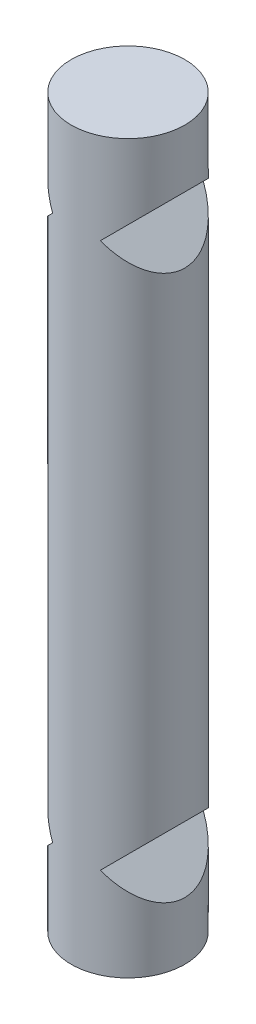
ISO-10303-21;
HEADER;
FILE_DESCRIPTION(('STEP AP214'),'2;1');
FILE_NAME('part.step','',(''),(''),'','','');
FILE_SCHEMA(('AUTOMOTIVE_DESIGN { 1 0 10303 214 1 1 1 1 }'));
ENDSEC;
DATA;
#1=APPLICATION_CONTEXT('core data for automotive mechanical design processes');
#2=APPLICATION_PROTOCOL_DEFINITION('international standard','automotive_design',2000,#1);
#3=PRODUCT_CONTEXT('',#1,'mechanical');
#4=PRODUCT('Part','Part','',(#3));
#5=PRODUCT_RELATED_PRODUCT_CATEGORY('part','',(#4));
#6=PRODUCT_DEFINITION_FORMATION('','',#4);
#7=PRODUCT_DEFINITION_CONTEXT('part definition',#1,'design');
#8=PRODUCT_DEFINITION('design','',#6,#7);
#9=PRODUCT_DEFINITION_SHAPE('','',#8);
#10=(LENGTH_UNIT() NAMED_UNIT(*) SI_UNIT(.MILLI.,.METRE.));
#11=(NAMED_UNIT(*) PLANE_ANGLE_UNIT() SI_UNIT($,.RADIAN.));
#12=(NAMED_UNIT(*) SI_UNIT($,.STERADIAN.) SOLID_ANGLE_UNIT());
#13=UNCERTAINTY_MEASURE_WITH_UNIT(LENGTH_MEASURE(1.E-05),#10,'distance_accuracy_value','');
#14=(GEOMETRIC_REPRESENTATION_CONTEXT(3) GLOBAL_UNCERTAINTY_ASSIGNED_CONTEXT((#13)) GLOBAL_UNIT_ASSIGNED_CONTEXT((#10,
#11,#12)) REPRESENTATION_CONTEXT('',''));
#15=CARTESIAN_POINT('',(0.,0.,0.));
#16=DIRECTION('',(0.,0.,1.));
#17=DIRECTION('',(1.,0.,0.));
#18=AXIS2_PLACEMENT_3D('',#15,#16,#17);
#19=CARTESIAN_POINT('',(0.,6.,0.));
#20=DIRECTION('',(0.,-1.,0.));
#21=DIRECTION('',(0.,0.,-1.));
#22=AXIS2_PLACEMENT_3D('',#19,#20,#21);
#23=CYLINDRICAL_SURFACE('',#22,1.25);
#24=CARTESIAN_POINT('',(0.,-2.47523687851957,0.));
#25=DIRECTION('',(-0.707106781186543,-0.707106781186552,0.));
#26=DIRECTION('',(0.707106781186552,-0.707106781186543,0.));
#27=AXIS2_PLACEMENT_3D('',#24,#25,#26);
#28=ELLIPSE('',#27,1.76776695296636,1.25);
#29=CARTESIAN_POINT('',(0.524763121480433,-3.,-1.13451472724426));
#30=VERTEX_POINT('',#29);
#31=CARTESIAN_POINT('',(0.524763121480433,-3.,1.13451472724426));
#32=VERTEX_POINT('',#31);
#33=EDGE_CURVE('E11',#30,#32,#28,.T.);
#34=ORIENTED_EDGE('',*,*,#33,.T.);
#35=CARTESIAN_POINT('',(0.,-3.52476312148043,0.));
#36=DIRECTION('',(-0.707106781186546,0.707106781186549,0.));
#37=DIRECTION('',(-0.707106781186549,-0.707106781186546,0.));
#38=AXIS2_PLACEMENT_3D('',#35,#36,#37);
#39=ELLIPSE('',#38,1.76776695296636,1.25);
#40=EDGE_CURVE('E47',#32,#30,#39,.T.);
#41=ORIENTED_EDGE('',*,*,#40,.T.);
#42=EDGE_LOOP('',(#34,#41));
#43=FACE_BOUND('',#42,.T.);
#44=CARTESIAN_POINT('',(0.,-2.47523687851959,0.));
#45=DIRECTION('',(0.707106781186546,-0.707106781186549,0.));
#46=DIRECTION('',(-0.707106781186549,-0.707106781186546,0.));
#47=AXIS2_PLACEMENT_3D('',#44,#45,#46);
#48=ELLIPSE('',#47,1.76776695296636,1.25);
#49=CARTESIAN_POINT('',(-0.524763121480417,-3.,1.13451472724426));
#50=VERTEX_POINT('',#49);
#51=CARTESIAN_POINT('',(-0.524763121480417,-3.,-1.13451472724427));
#52=VERTEX_POINT('',#51);
#53=EDGE_CURVE('E116',#50,#52,#48,.T.);
#54=ORIENTED_EDGE('',*,*,#53,.T.);
#55=CARTESIAN_POINT('',(0.,-3.52476312148041,0.));
#56=DIRECTION('',(0.707106781186543,0.707106781186552,0.));
#57=DIRECTION('',(0.707106781186552,-0.707106781186543,0.));
#58=AXIS2_PLACEMENT_3D('',#55,#56,#57);
#59=ELLIPSE('',#58,1.76776695296636,1.25);
#60=EDGE_CURVE('E120',#52,#50,#59,.T.);
#61=ORIENTED_EDGE('',*,*,#60,.T.);
#62=EDGE_LOOP('',(#54,#61));
#63=FACE_BOUND('',#62,.T.);
#64=CARTESIAN_POINT('',(0.,9.52476312148042,0.));
#65=DIRECTION('',(0.707106781186544,-0.707106781186551,0.));
#66=DIRECTION('',(-0.707106781186551,-0.707106781186544,0.));
#67=AXIS2_PLACEMENT_3D('',#64,#65,#66);
#68=ELLIPSE('',#67,1.76776695296636,1.25);
#69=CARTESIAN_POINT('',(-0.524763121480425,9.,1.13451472724426));
#70=VERTEX_POINT('',#69);
#71=CARTESIAN_POINT('',(-0.524763121480425,9.,-1.13451472724426));
#72=VERTEX_POINT('',#71);
#73=EDGE_CURVE('E85',#70,#72,#68,.T.);
#74=ORIENTED_EDGE('',*,*,#73,.T.);
#75=CARTESIAN_POINT('',(0.,8.47523687851958,0.));
#76=DIRECTION('',(0.707106781186544,0.707106781186551,0.));
#77=DIRECTION('',(0.707106781186551,-0.707106781186544,0.));
#78=AXIS2_PLACEMENT_3D('',#75,#76,#77);
#79=ELLIPSE('',#78,1.76776695296636,1.25);
#80=EDGE_CURVE('E112',#72,#70,#79,.T.);
#81=ORIENTED_EDGE('',*,*,#80,.T.);
#82=EDGE_LOOP('',(#74,#81));
#83=FACE_BOUND('',#82,.T.);
#84=CARTESIAN_POINT('',(0.,9.52476312148042,0.));
#85=DIRECTION('',(-0.707106781186544,-0.707106781186551,0.));
#86=DIRECTION('',(0.707106781186551,-0.707106781186544,0.));
#87=AXIS2_PLACEMENT_3D('',#84,#85,#86);
#88=ELLIPSE('',#87,1.76776695296636,1.25);
#89=CARTESIAN_POINT('',(0.524763121480425,9.,-1.13451472724426));
#90=VERTEX_POINT('',#89);
#91=CARTESIAN_POINT('',(0.524763121480425,9.,1.13451472724426));
#92=VERTEX_POINT('',#91);
#93=EDGE_CURVE('E80',#90,#92,#88,.T.);
#94=ORIENTED_EDGE('',*,*,#93,.T.);
#95=CARTESIAN_POINT('',(0.,8.47523687851958,0.));
#96=DIRECTION('',(-0.707106781186544,0.707106781186551,0.));
#97=DIRECTION('',(-0.707106781186551,-0.707106781186544,0.));
#98=AXIS2_PLACEMENT_3D('',#95,#96,#97);
#99=ELLIPSE('',#98,1.76776695296636,1.25);
#100=EDGE_CURVE('E82',#92,#90,#99,.T.);
#101=ORIENTED_EDGE('',*,*,#100,.T.);
#102=EDGE_LOOP('',(#94,#101));
#103=FACE_BOUND('',#102,.T.);
#104=CARTESIAN_POINT('',(0.,-5.,0.));
#105=DIRECTION('',(0.,-1.,0.));
#106=DIRECTION('',(0.,0.,-1.));
#107=AXIS2_PLACEMENT_3D('',#104,#105,#106);
#108=CIRCLE('',#107,1.25);
#109=CARTESIAN_POINT('',(0.,-5.,-1.25));
#110=VERTEX_POINT('',#109);
#111=EDGE_CURVE('E89',#110,#110,#108,.T.);
#112=ORIENTED_EDGE('',*,*,#111,.F.);
#113=EDGE_LOOP('',(#112));
#114=FACE_BOUND('',#113,.T.);
#115=CARTESIAN_POINT('',(0.,11.,0.));
#116=DIRECTION('',(0.,1.,0.));
#117=DIRECTION('',(0.,0.,1.));
#118=AXIS2_PLACEMENT_3D('',#115,#116,#117);
#119=CIRCLE('',#118,1.25);
#120=CARTESIAN_POINT('',(0.,11.,1.25));
#121=VERTEX_POINT('',#120);
#122=EDGE_CURVE('E93',#121,#121,#119,.T.);
#123=ORIENTED_EDGE('',*,*,#122,.F.);
#124=EDGE_LOOP('',(#123));
#125=FACE_BOUND('',#124,.T.);
#126=ADVANCED_FACE('F39',(#43,#63,#83,#103,#114,#125),#23,.T.);
#127=CARTESIAN_POINT('',(0.,-5.,0.));
#128=DIRECTION('',(0.,-1.,0.));
#129=DIRECTION('',(0.,0.,-1.));
#130=AXIS2_PLACEMENT_3D('',#127,#128,#129);
#131=PLANE('',#130);
#132=ORIENTED_EDGE('',*,*,#111,.T.);
#133=EDGE_LOOP('',(#132));
#134=FACE_BOUND('',#133,.T.);
#135=ADVANCED_FACE('F150',(#134),#131,.T.);
#136=CARTESIAN_POINT('',(0.,11.,0.));
#137=DIRECTION('',(0.,1.,0.));
#138=DIRECTION('',(0.,0.,1.));
#139=AXIS2_PLACEMENT_3D('',#136,#137,#138);
#140=PLANE('',#139);
#141=ORIENTED_EDGE('',*,*,#122,.T.);
#142=EDGE_LOOP('',(#141));
#143=FACE_BOUND('',#142,.T.);
#144=ADVANCED_FACE('F154',(#143),#140,.T.);
#145=CARTESIAN_POINT('',(0.524763121480425,9.,-1.25));
#146=DIRECTION('',(-0.707106781186544,-0.707106781186551,0.));
#147=DIRECTION('',(0.707106781186551,-0.707106781186544,0.));
#148=AXIS2_PLACEMENT_3D('',#145,#146,#147);
#149=PLANE('',#148);
#150=ORIENTED_EDGE('',*,*,#93,.F.);
#151=DIRECTION('',(0.,0.,1.));
#152=VECTOR('',#151,1.);
#153=CARTESIAN_POINT('',(0.524763121480425,9.,-1.25));
#154=LINE('',#153,#152);
#155=EDGE_CURVE('E60',#90,#92,#154,.T.);
#156=ORIENTED_EDGE('',*,*,#155,.T.);
#157=EDGE_LOOP('',(#150,#156));
#158=FACE_BOUND('',#157,.T.);
#159=ADVANCED_FACE('F91',(#158),#149,.F.);
#160=CARTESIAN_POINT('',(0.524763121480425,9.,-1.25));
#161=DIRECTION('',(-0.707106781186544,0.707106781186551,0.));
#162=DIRECTION('',(-0.707106781186551,-0.707106781186544,0.));
#163=AXIS2_PLACEMENT_3D('',#160,#161,#162);
#164=PLANE('',#163);
#165=ORIENTED_EDGE('',*,*,#155,.F.);
#166=ORIENTED_EDGE('',*,*,#100,.F.);
#167=EDGE_LOOP('',(#165,#166));
#168=FACE_BOUND('',#167,.T.);
#169=ADVANCED_FACE('F87',(#168),#164,.F.);
#170=CARTESIAN_POINT('',(-0.524763121480425,9.,-1.25));
#171=DIRECTION('',(0.707106781186544,0.707106781186551,0.));
#172=DIRECTION('',(-0.707106781186551,0.707106781186544,0.));
#173=AXIS2_PLACEMENT_3D('',#170,#171,#172);
#174=PLANE('',#173);
#175=DIRECTION('',(0.,0.,1.));
#176=VECTOR('',#175,1.);
#177=CARTESIAN_POINT('',(-0.524763121480425,9.,-1.25));
#178=LINE('',#177,#176);
#179=EDGE_CURVE('E94',#72,#70,#178,.T.);
#180=ORIENTED_EDGE('',*,*,#179,.T.);
#181=ORIENTED_EDGE('',*,*,#80,.F.);
#182=EDGE_LOOP('',(#180,#181));
#183=FACE_BOUND('',#182,.T.);
#184=ADVANCED_FACE('F165',(#183),#174,.F.);
#185=CARTESIAN_POINT('',(-0.524763121480425,9.,-1.25));
#186=DIRECTION('',(0.707106781186544,-0.707106781186551,0.));
#187=DIRECTION('',(0.707106781186551,0.707106781186544,0.));
#188=AXIS2_PLACEMENT_3D('',#185,#186,#187);
#189=PLANE('',#188);
#190=ORIENTED_EDGE('',*,*,#73,.F.);
#191=ORIENTED_EDGE('',*,*,#179,.F.);
#192=EDGE_LOOP('',(#190,#191));
#193=FACE_BOUND('',#192,.T.);
#194=ADVANCED_FACE('F146',(#193),#189,.F.);
#195=CARTESIAN_POINT('',(-0.524763121480417,-3.,-1.25));
#196=DIRECTION('',(0.707106781186543,0.707106781186552,0.));
#197=DIRECTION('',(-0.707106781186552,0.707106781186543,0.));
#198=AXIS2_PLACEMENT_3D('',#195,#196,#197);
#199=PLANE('',#198);
#200=DIRECTION('',(0.,0.,1.));
#201=VECTOR('',#200,1.);
#202=CARTESIAN_POINT('',(-0.524763121480417,-3.,-1.25));
#203=LINE('',#202,#201);
#204=EDGE_CURVE('E101',#52,#50,#203,.T.);
#205=ORIENTED_EDGE('',*,*,#204,.T.);
#206=ORIENTED_EDGE('',*,*,#60,.F.);
#207=EDGE_LOOP('',(#205,#206));
#208=FACE_BOUND('',#207,.T.);
#209=ADVANCED_FACE('F135',(#208),#199,.F.);
#210=CARTESIAN_POINT('',(-0.524763121480417,-3.,-1.25));
#211=DIRECTION('',(0.707106781186546,-0.707106781186549,0.));
#212=DIRECTION('',(0.707106781186549,0.707106781186546,0.));
#213=AXIS2_PLACEMENT_3D('',#210,#211,#212);
#214=PLANE('',#213);
#215=ORIENTED_EDGE('',*,*,#53,.F.);
#216=ORIENTED_EDGE('',*,*,#204,.F.);
#217=EDGE_LOOP('',(#215,#216));
#218=FACE_BOUND('',#217,.T.);
#219=ADVANCED_FACE('F138',(#218),#214,.F.);
#220=CARTESIAN_POINT('',(0.524763121480433,-3.,-1.25));
#221=DIRECTION('',(-0.707106781186543,-0.707106781186552,0.));
#222=DIRECTION('',(0.707106781186552,-0.707106781186543,0.));
#223=AXIS2_PLACEMENT_3D('',#220,#221,#222);
#224=PLANE('',#223);
#225=ORIENTED_EDGE('',*,*,#33,.F.);
#226=DIRECTION('',(0.,0.,1.));
#227=VECTOR('',#226,1.);
#228=CARTESIAN_POINT('',(0.524763121480433,-3.,-1.25));
#229=LINE('',#228,#227);
#230=EDGE_CURVE('E53',#30,#32,#229,.T.);
#231=ORIENTED_EDGE('',*,*,#230,.T.);
#232=EDGE_LOOP('',(#225,#231));
#233=FACE_BOUND('',#232,.T.);
#234=ADVANCED_FACE('F129',(#233),#224,.F.);
#235=CARTESIAN_POINT('',(0.524763121480433,-3.,-1.25));
#236=DIRECTION('',(-0.707106781186546,0.707106781186549,0.));
#237=DIRECTION('',(-0.707106781186549,-0.707106781186546,0.));
#238=AXIS2_PLACEMENT_3D('',#235,#236,#237);
#239=PLANE('',#238);
#240=ORIENTED_EDGE('',*,*,#230,.F.);
#241=ORIENTED_EDGE('',*,*,#40,.F.);
#242=EDGE_LOOP('',(#240,#241));
#243=FACE_BOUND('',#242,.T.);
#244=ADVANCED_FACE('F127',(#243),#239,.F.);
#245=CLOSED_SHELL('',(#126,#135,#144,#159,#169,#184,#194,#209,#219,#234,#244));
#246=MANIFOLD_SOLID_BREP('B2',#245);
#247=ADVANCED_BREP_SHAPE_REPRESENTATION('',(#18,#246),#14);
#248=SHAPE_DEFINITION_REPRESENTATION(#9,#247);
ENDSEC;
END-ISO-10303-21;
